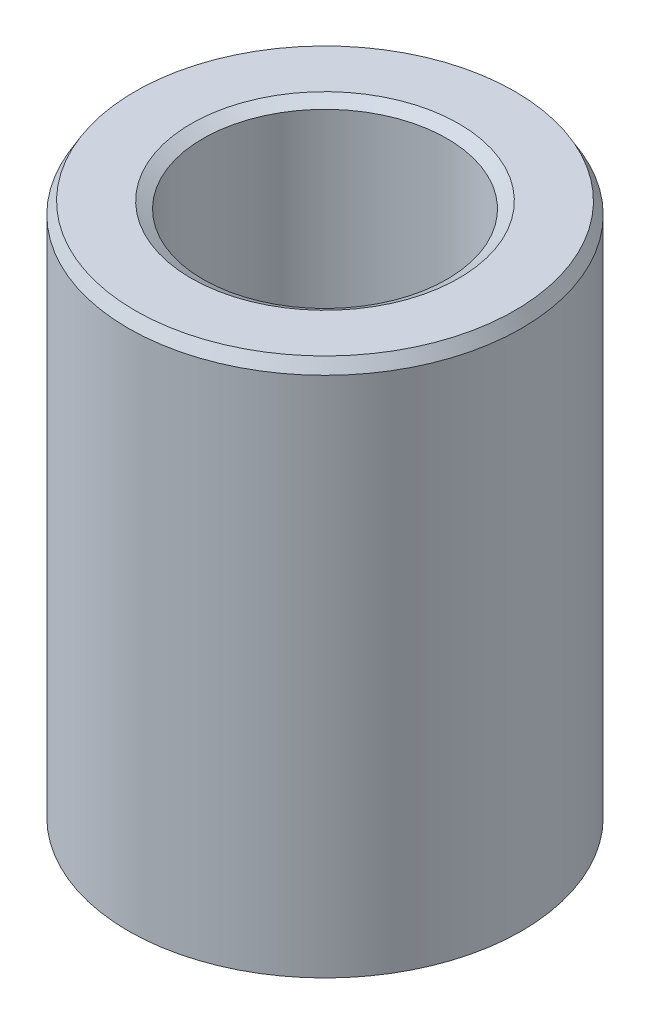
ISO-10303-21;
HEADER;
FILE_DESCRIPTION(('STEP AP214'),'2;1');
FILE_NAME('part.step','',(''),(''),'','','');
FILE_SCHEMA(('AUTOMOTIVE_DESIGN { 1 0 10303 214 1 1 1 1 }'));
ENDSEC;
DATA;
#1=APPLICATION_CONTEXT('core data for automotive mechanical design processes');
#2=APPLICATION_PROTOCOL_DEFINITION('international standard','automotive_design',2000,#1);
#3=PRODUCT_CONTEXT('',#1,'mechanical');
#4=PRODUCT('Part','Part','',(#3));
#5=PRODUCT_RELATED_PRODUCT_CATEGORY('part','',(#4));
#6=PRODUCT_DEFINITION_FORMATION('','',#4);
#7=PRODUCT_DEFINITION_CONTEXT('part definition',#1,'design');
#8=PRODUCT_DEFINITION('design','',#6,#7);
#9=PRODUCT_DEFINITION_SHAPE('','',#8);
#10=(LENGTH_UNIT() NAMED_UNIT(*) SI_UNIT(.MILLI.,.METRE.));
#11=(NAMED_UNIT(*) PLANE_ANGLE_UNIT() SI_UNIT($,.RADIAN.));
#12=(NAMED_UNIT(*) SI_UNIT($,.STERADIAN.) SOLID_ANGLE_UNIT());
#13=UNCERTAINTY_MEASURE_WITH_UNIT(LENGTH_MEASURE(1.E-05),#10,'distance_accuracy_value','');
#14=(GEOMETRIC_REPRESENTATION_CONTEXT(3) GLOBAL_UNCERTAINTY_ASSIGNED_CONTEXT((#13)) GLOBAL_UNIT_ASSIGNED_CONTEXT((#10,
#11,#12)) REPRESENTATION_CONTEXT('',''));
#15=CARTESIAN_POINT('',(0.,0.,0.));
#16=DIRECTION('',(0.,0.,1.));
#17=DIRECTION('',(1.,0.,0.));
#18=AXIS2_PLACEMENT_3D('',#15,#16,#17);
#19=CARTESIAN_POINT('',(0.,109.942870639772,0.));
#20=DIRECTION('',(0.,-1.,0.));
#21=DIRECTION('',(0.,0.,-1.));
#22=AXIS2_PLACEMENT_3D('',#19,#20,#21);
#23=CYLINDRICAL_SURFACE('',#22,40.);
#24=CARTESIAN_POINT('',(0.,1.39795919495009,0.));
#25=DIRECTION('',(0.,1.,0.));
#26=DIRECTION('',(0.,0.,1.));
#27=AXIS2_PLACEMENT_3D('',#24,#25,#26);
#28=CIRCLE('',#27,40.);
#29=CARTESIAN_POINT('',(0.,1.39795919495009,40.));
#30=VERTEX_POINT('',#29);
#31=EDGE_CURVE('E10',#30,#30,#28,.T.);
#32=ORIENTED_EDGE('',*,*,#31,.T.);
#33=EDGE_LOOP('',(#32));
#34=FACE_BOUND('',#33,.T.);
#35=CARTESIAN_POINT('',(0.,107.521534287211,0.));
#36=DIRECTION('',(0.,1.,0.));
#37=DIRECTION('',(0.,0.,1.));
#38=AXIS2_PLACEMENT_3D('',#35,#36,#37);
#39=CIRCLE('',#38,40.);
#40=CARTESIAN_POINT('',(0.,107.521534287211,40.));
#41=VERTEX_POINT('',#40);
#42=EDGE_CURVE('E50',#41,#41,#39,.F.);
#43=ORIENTED_EDGE('',*,*,#42,.T.);
#44=EDGE_LOOP('',(#43));
#45=FACE_BOUND('',#44,.T.);
#46=ADVANCED_FACE('F39',(#34,#45),#23,.T.);
#47=CARTESIAN_POINT('',(0.,109.942870639772,0.));
#48=DIRECTION('',(0.,1.,0.));
#49=DIRECTION('',(0.,0.,1.));
#50=AXIS2_PLACEMENT_3D('',#47,#48,#49);
#51=PLANE('',#50);
#52=CARTESIAN_POINT('',(0.,109.942870639772,0.));
#53=DIRECTION('',(0.,1.,0.));
#54=DIRECTION('',(0.,0.,1.));
#55=AXIS2_PLACEMENT_3D('',#52,#53,#54);
#56=CIRCLE('',#55,27.2269526161409);
#57=CARTESIAN_POINT('',(0.,109.942870639772,27.2269526161409));
#58=VERTEX_POINT('',#57);
#59=EDGE_CURVE('E58',#58,#58,#56,.F.);
#60=ORIENTED_EDGE('',*,*,#59,.T.);
#61=EDGE_LOOP('',(#60));
#62=FACE_BOUND('',#61,.T.);
#63=CARTESIAN_POINT('',(0.,109.942870639772,0.));
#64=DIRECTION('',(0.,1.,0.));
#65=DIRECTION('',(0.,0.,1.));
#66=AXIS2_PLACEMENT_3D('',#63,#64,#65);
#67=CIRCLE('',#66,38.6020408050499);
#68=CARTESIAN_POINT('',(0.,109.942870639772,38.6020408050499));
#69=VERTEX_POINT('',#68);
#70=EDGE_CURVE('E61',#69,#69,#67,.T.);
#71=ORIENTED_EDGE('',*,*,#70,.T.);
#72=EDGE_LOOP('',(#71));
#73=FACE_BOUND('',#72,.T.);
#74=ADVANCED_FACE('F88',(#62,#73),#51,.T.);
#75=CARTESIAN_POINT('',(0.,0.,0.));
#76=DIRECTION('',(0.,1.,0.));
#77=DIRECTION('',(0.,0.,1.));
#78=AXIS2_PLACEMENT_3D('',#75,#76,#77);
#79=PLANE('',#78);
#80=CARTESIAN_POINT('',(0.,0.,0.));
#81=DIRECTION('',(0.,1.,0.));
#82=DIRECTION('',(0.,0.,1.));
#83=AXIS2_PLACEMENT_3D('',#80,#81,#82);
#84=CIRCLE('',#83,26.2035754585293);
#85=CARTESIAN_POINT('',(0.,0.,26.2035754585293));
#86=VERTEX_POINT('',#85);
#87=EDGE_CURVE('E51',#86,#86,#84,.T.);
#88=ORIENTED_EDGE('',*,*,#87,.T.);
#89=EDGE_LOOP('',(#88));
#90=FACE_BOUND('',#89,.T.);
#91=CARTESIAN_POINT('',(0.,0.,0.));
#92=DIRECTION('',(0.,1.,0.));
#93=DIRECTION('',(0.,0.,1.));
#94=AXIS2_PLACEMENT_3D('',#91,#92,#93);
#95=CIRCLE('',#94,37.5786636474384);
#96=CARTESIAN_POINT('',(0.,0.,37.5786636474384));
#97=VERTEX_POINT('',#96);
#98=EDGE_CURVE('E54',#97,#97,#95,.F.);
#99=ORIENTED_EDGE('',*,*,#98,.T.);
#100=EDGE_LOOP('',(#99));
#101=FACE_BOUND('',#100,.T.);
#102=ADVANCED_FACE('F83',(#90,#101),#79,.F.);
#103=CARTESIAN_POINT('',(0.,109.942870639772,0.));
#104=DIRECTION('',(0.,-1.,0.));
#105=DIRECTION('',(0.,0.,-1.));
#106=AXIS2_PLACEMENT_3D('',#103,#104,#105);
#107=CYLINDRICAL_SURFACE('',#106,24.8056162635792);
#108=CARTESIAN_POINT('',(0.,108.544911444822,0.));
#109=DIRECTION('',(0.,1.,0.));
#110=DIRECTION('',(0.,0.,1.));
#111=AXIS2_PLACEMENT_3D('',#108,#109,#110);
#112=CIRCLE('',#111,24.8056162635792);
#113=CARTESIAN_POINT('',(0.,108.544911444822,24.8056162635792));
#114=VERTEX_POINT('',#113);
#115=EDGE_CURVE('E67',#114,#114,#112,.T.);
#116=ORIENTED_EDGE('',*,*,#115,.T.);
#117=EDGE_LOOP('',(#116));
#118=FACE_BOUND('',#117,.T.);
#119=CARTESIAN_POINT('',(0.,2.42133635256159,0.));
#120=DIRECTION('',(0.,1.,0.));
#121=DIRECTION('',(0.,0.,1.));
#122=AXIS2_PLACEMENT_3D('',#119,#120,#121);
#123=CIRCLE('',#122,24.8056162635792);
#124=CARTESIAN_POINT('',(0.,2.42133635256159,24.8056162635792));
#125=VERTEX_POINT('',#124);
#126=EDGE_CURVE('E69',#125,#125,#123,.F.);
#127=ORIENTED_EDGE('',*,*,#126,.T.);
#128=EDGE_LOOP('',(#127));
#129=FACE_BOUND('',#128,.T.);
#130=ADVANCED_FACE('F71',(#118,#129),#107,.F.);
#131=CARTESIAN_POINT('',(0.,108.544911444822,0.));
#132=DIRECTION('',(0.,1.,0.));
#133=DIRECTION('',(0.,0.,1.));
#134=AXIS2_PLACEMENT_3D('',#131,#132,#133);
#135=CONICAL_SURFACE('',#134,24.8056162635792,1.04719755119661);
#136=ORIENTED_EDGE('',*,*,#59,.F.);
#137=EDGE_LOOP('',(#136));
#138=FACE_BOUND('',#137,.T.);
#139=ORIENTED_EDGE('',*,*,#115,.F.);
#140=EDGE_LOOP('',(#139));
#141=FACE_BOUND('',#140,.T.);
#142=ADVANCED_FACE('F77',(#138,#141),#135,.F.);
#143=CARTESIAN_POINT('',(0.,0.,0.));
#144=DIRECTION('',(0.,-1.,0.));
#145=DIRECTION('',(0.,0.,-1.));
#146=AXIS2_PLACEMENT_3D('',#143,#144,#145);
#147=CONICAL_SURFACE('',#146,26.2035754585293,0.523598775598295);
#148=ORIENTED_EDGE('',*,*,#126,.F.);
#149=EDGE_LOOP('',(#148));
#150=FACE_BOUND('',#149,.T.);
#151=ORIENTED_EDGE('',*,*,#87,.F.);
#152=EDGE_LOOP('',(#151));
#153=FACE_BOUND('',#152,.T.);
#154=ADVANCED_FACE('F73',(#150,#153),#147,.F.);
#155=CARTESIAN_POINT('',(0.,1.39795919495009,0.));
#156=DIRECTION('',(0.,1.,0.));
#157=DIRECTION('',(0.,0.,1.));
#158=AXIS2_PLACEMENT_3D('',#155,#156,#157);
#159=CONICAL_SURFACE('',#158,40.,1.0471975511966);
#160=ORIENTED_EDGE('',*,*,#98,.F.);
#161=EDGE_LOOP('',(#160));
#162=FACE_BOUND('',#161,.T.);
#163=ORIENTED_EDGE('',*,*,#31,.F.);
#164=EDGE_LOOP('',(#163));
#165=FACE_BOUND('',#164,.T.);
#166=ADVANCED_FACE('F76',(#162,#165),#159,.T.);
#167=CARTESIAN_POINT('',(0.,109.942870639772,0.));
#168=DIRECTION('',(0.,-1.,0.));
#169=DIRECTION('',(0.,0.,-1.));
#170=AXIS2_PLACEMENT_3D('',#167,#168,#169);
#171=CONICAL_SURFACE('',#170,38.6020408050499,0.523598775598299);
#172=ORIENTED_EDGE('',*,*,#42,.F.);
#173=EDGE_LOOP('',(#172));
#174=FACE_BOUND('',#173,.T.);
#175=ORIENTED_EDGE('',*,*,#70,.F.);
#176=EDGE_LOOP('',(#175));
#177=FACE_BOUND('',#176,.T.);
#178=ADVANCED_FACE('F45',(#174,#177),#171,.T.);
#179=CLOSED_SHELL('',(#46,#74,#102,#130,#142,#154,#166,#178));
#180=MANIFOLD_SOLID_BREP('B2',#179);
#181=ADVANCED_BREP_SHAPE_REPRESENTATION('',(#18,#180),#14);
#182=SHAPE_DEFINITION_REPRESENTATION(#9,#181);
ENDSEC;
END-ISO-10303-21;
